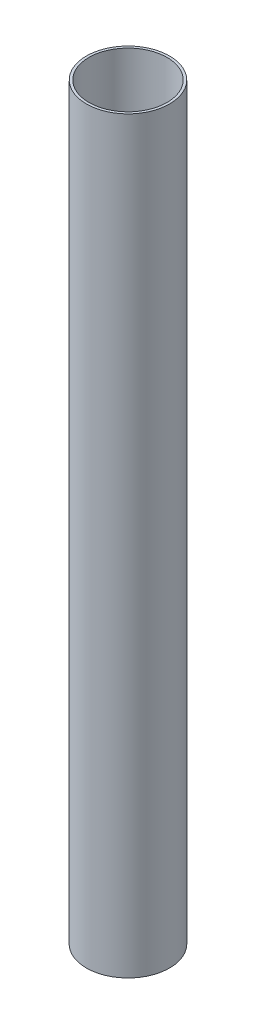
ISO-10303-21;
HEADER;
FILE_DESCRIPTION(('STEP AP214'),'2;1');
FILE_NAME('part.step','',(''),(''),'','','');
FILE_SCHEMA(('AUTOMOTIVE_DESIGN { 1 0 10303 214 1 1 1 1 }'));
ENDSEC;
DATA;
#1=APPLICATION_CONTEXT('core data for automotive mechanical design processes');
#2=APPLICATION_PROTOCOL_DEFINITION('international standard','automotive_design',2000,#1);
#3=PRODUCT_CONTEXT('',#1,'mechanical');
#4=PRODUCT('Part','Part','',(#3));
#5=PRODUCT_RELATED_PRODUCT_CATEGORY('part','',(#4));
#6=PRODUCT_DEFINITION_FORMATION('','',#4);
#7=PRODUCT_DEFINITION_CONTEXT('part definition',#1,'design');
#8=PRODUCT_DEFINITION('design','',#6,#7);
#9=PRODUCT_DEFINITION_SHAPE('','',#8);
#10=(LENGTH_UNIT() NAMED_UNIT(*) SI_UNIT(.MILLI.,.METRE.));
#11=(NAMED_UNIT(*) PLANE_ANGLE_UNIT() SI_UNIT($,.RADIAN.));
#12=(NAMED_UNIT(*) SI_UNIT($,.STERADIAN.) SOLID_ANGLE_UNIT());
#13=UNCERTAINTY_MEASURE_WITH_UNIT(LENGTH_MEASURE(1.E-05),#10,'distance_accuracy_value','');
#14=(GEOMETRIC_REPRESENTATION_CONTEXT(3) GLOBAL_UNCERTAINTY_ASSIGNED_CONTEXT((#13)) GLOBAL_UNIT_ASSIGNED_CONTEXT((#10,
#11,#12)) REPRESENTATION_CONTEXT('',''));
#15=CARTESIAN_POINT('',(0.,0.,0.));
#16=DIRECTION('',(0.,0.,1.));
#17=DIRECTION('',(1.,0.,0.));
#18=AXIS2_PLACEMENT_3D('',#15,#16,#17);
#19=CARTESIAN_POINT('',(0.,114.3,0.));
#20=DIRECTION('',(0.,1.,0.));
#21=DIRECTION('',(0.,0.,1.));
#22=AXIS2_PLACEMENT_3D('',#19,#20,#21);
#23=PLANE('',#22);
#24=CARTESIAN_POINT('',(0.,114.3,0.));
#25=DIRECTION('',(0.,1.,0.));
#26=DIRECTION('',(0.,0.,1.));
#27=AXIS2_PLACEMENT_3D('',#24,#25,#26);
#28=CIRCLE('',#27,6.35);
#29=CARTESIAN_POINT('',(0.,114.3,6.35));
#30=VERTEX_POINT('',#29);
#31=EDGE_CURVE('E10',#30,#30,#28,.T.);
#32=ORIENTED_EDGE('',*,*,#31,.T.);
#33=EDGE_LOOP('',(#32));
#34=FACE_BOUND('',#33,.T.);
#35=CARTESIAN_POINT('',(0.,114.3,0.));
#36=DIRECTION('',(0.,1.,0.));
#37=DIRECTION('',(0.,0.,1.));
#38=AXIS2_PLACEMENT_3D('',#35,#36,#37);
#39=CIRCLE('',#38,5.969);
#40=CARTESIAN_POINT('',(0.,114.3,5.969));
#41=VERTEX_POINT('',#40);
#42=EDGE_CURVE('E50',#41,#41,#39,.T.);
#43=ORIENTED_EDGE('',*,*,#42,.F.);
#44=EDGE_LOOP('',(#43));
#45=FACE_BOUND('',#44,.T.);
#46=ADVANCED_FACE('F37',(#34,#45),#23,.T.);
#47=CARTESIAN_POINT('',(0.,0.,0.));
#48=DIRECTION('',(0.,1.,0.));
#49=DIRECTION('',(0.,0.,1.));
#50=AXIS2_PLACEMENT_3D('',#47,#48,#49);
#51=PLANE('',#50);
#52=CARTESIAN_POINT('',(0.,0.,0.));
#53=DIRECTION('',(0.,1.,0.));
#54=DIRECTION('',(0.,0.,1.));
#55=AXIS2_PLACEMENT_3D('',#52,#53,#54);
#56=CIRCLE('',#55,6.35);
#57=CARTESIAN_POINT('',(0.,0.,6.35));
#58=VERTEX_POINT('',#57);
#59=EDGE_CURVE('E41',#58,#58,#56,.T.);
#60=ORIENTED_EDGE('',*,*,#59,.F.);
#61=EDGE_LOOP('',(#60));
#62=FACE_BOUND('',#61,.T.);
#63=CARTESIAN_POINT('',(0.,0.,0.));
#64=DIRECTION('',(0.,1.,0.));
#65=DIRECTION('',(0.,0.,1.));
#66=AXIS2_PLACEMENT_3D('',#63,#64,#65);
#67=CIRCLE('',#66,5.969);
#68=CARTESIAN_POINT('',(0.,0.,5.969));
#69=VERTEX_POINT('',#68);
#70=EDGE_CURVE('E52',#69,#69,#67,.T.);
#71=ORIENTED_EDGE('',*,*,#70,.T.);
#72=EDGE_LOOP('',(#71));
#73=FACE_BOUND('',#72,.T.);
#74=ADVANCED_FACE('F64',(#62,#73),#51,.F.);
#75=CARTESIAN_POINT('',(0.,114.3,0.));
#76=DIRECTION('',(0.,-1.,0.));
#77=DIRECTION('',(0.,0.,-1.));
#78=AXIS2_PLACEMENT_3D('',#75,#76,#77);
#79=CYLINDRICAL_SURFACE('',#78,6.35);
#80=ORIENTED_EDGE('',*,*,#31,.F.);
#81=EDGE_LOOP('',(#80));
#82=FACE_BOUND('',#81,.T.);
#83=ORIENTED_EDGE('',*,*,#59,.T.);
#84=EDGE_LOOP('',(#83));
#85=FACE_BOUND('',#84,.T.);
#86=ADVANCED_FACE('F39',(#82,#85),#79,.T.);
#87=CARTESIAN_POINT('',(0.,114.3,0.));
#88=DIRECTION('',(0.,-1.,0.));
#89=DIRECTION('',(0.,0.,-1.));
#90=AXIS2_PLACEMENT_3D('',#87,#88,#89);
#91=CYLINDRICAL_SURFACE('',#90,5.969);
#92=ORIENTED_EDGE('',*,*,#42,.T.);
#93=EDGE_LOOP('',(#92));
#94=FACE_BOUND('',#93,.T.);
#95=ORIENTED_EDGE('',*,*,#70,.F.);
#96=EDGE_LOOP('',(#95));
#97=FACE_BOUND('',#96,.T.);
#98=ADVANCED_FACE('F60',(#94,#97),#91,.F.);
#99=CLOSED_SHELL('',(#46,#74,#86,#98));
#100=MANIFOLD_SOLID_BREP('B2',#99);
#101=ADVANCED_BREP_SHAPE_REPRESENTATION('',(#18,#100),#14);
#102=SHAPE_DEFINITION_REPRESENTATION(#9,#101);
ENDSEC;
END-ISO-10303-21;
